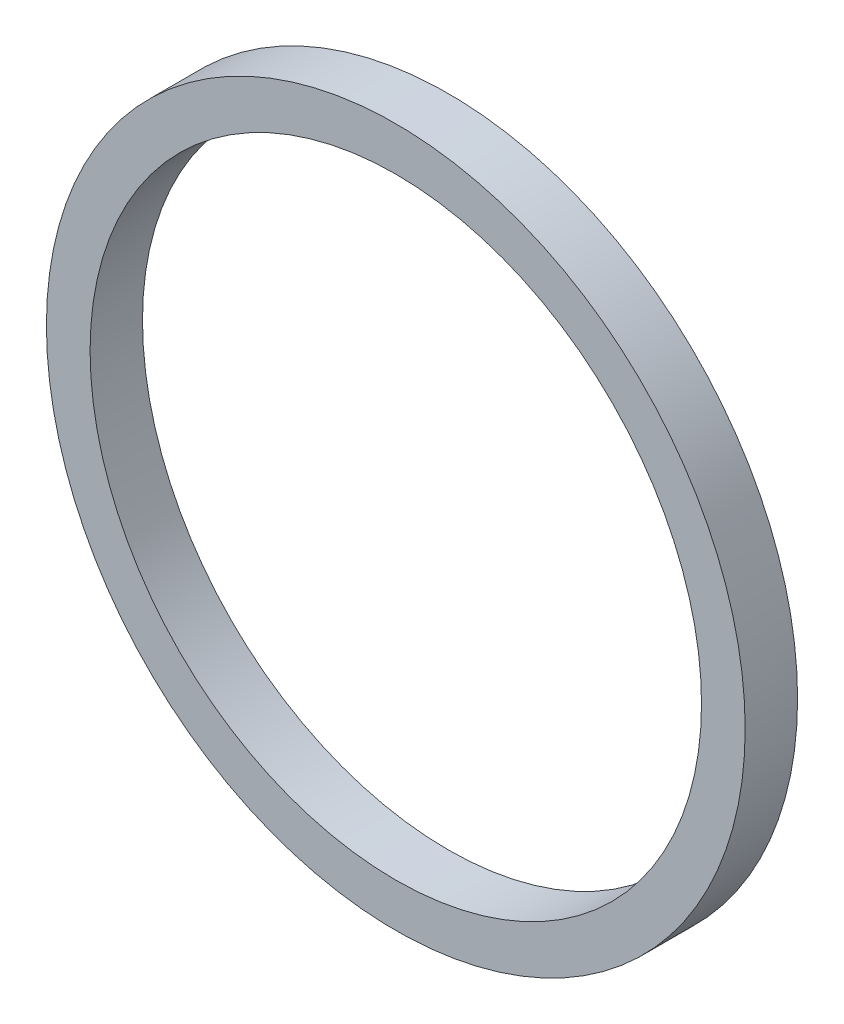
ISO-10303-21;
HEADER;
FILE_DESCRIPTION(('STEP AP214'),'2;1');
FILE_NAME('part.step','',(''),(''),'','','');
FILE_SCHEMA(('AUTOMOTIVE_DESIGN { 1 0 10303 214 1 1 1 1 }'));
ENDSEC;
DATA;
#1=APPLICATION_CONTEXT('core data for automotive mechanical design processes');
#2=APPLICATION_PROTOCOL_DEFINITION('international standard','automotive_design',2000,#1);
#3=PRODUCT_CONTEXT('',#1,'mechanical');
#4=PRODUCT('Part','Part','',(#3));
#5=PRODUCT_RELATED_PRODUCT_CATEGORY('part','',(#4));
#6=PRODUCT_DEFINITION_FORMATION('','',#4);
#7=PRODUCT_DEFINITION_CONTEXT('part definition',#1,'design');
#8=PRODUCT_DEFINITION('design','',#6,#7);
#9=PRODUCT_DEFINITION_SHAPE('','',#8);
#10=(LENGTH_UNIT() NAMED_UNIT(*) SI_UNIT(.MILLI.,.METRE.));
#11=(NAMED_UNIT(*) PLANE_ANGLE_UNIT() SI_UNIT($,.RADIAN.));
#12=(NAMED_UNIT(*) SI_UNIT($,.STERADIAN.) SOLID_ANGLE_UNIT());
#13=UNCERTAINTY_MEASURE_WITH_UNIT(LENGTH_MEASURE(1.E-05),#10,'distance_accuracy_value','');
#14=(GEOMETRIC_REPRESENTATION_CONTEXT(3) GLOBAL_UNCERTAINTY_ASSIGNED_CONTEXT((#13)) GLOBAL_UNIT_ASSIGNED_CONTEXT((#10,
#11,#12)) REPRESENTATION_CONTEXT('',''));
#15=CARTESIAN_POINT('',(0.,0.,0.));
#16=DIRECTION('',(0.,0.,1.));
#17=DIRECTION('',(1.,0.,0.));
#18=AXIS2_PLACEMENT_3D('',#15,#16,#17);
#19=CARTESIAN_POINT('',(0.,0.,6.));
#20=DIRECTION('',(0.,0.,1.));
#21=DIRECTION('',(1.,0.,0.));
#22=AXIS2_PLACEMENT_3D('',#19,#20,#21);
#23=PLANE('',#22);
#24=CARTESIAN_POINT('',(0.,0.,6.));
#25=DIRECTION('',(0.,0.,1.));
#26=DIRECTION('',(1.,0.,0.));
#27=AXIS2_PLACEMENT_3D('',#24,#25,#26);
#28=CIRCLE('',#27,40.);
#29=CARTESIAN_POINT('',(40.,0.,6.));
#30=VERTEX_POINT('',#29);
#31=EDGE_CURVE('E10',#30,#30,#28,.T.);
#32=ORIENTED_EDGE('',*,*,#31,.T.);
#33=EDGE_LOOP('',(#32));
#34=FACE_BOUND('',#33,.T.);
#35=CARTESIAN_POINT('',(0.,0.,6.));
#36=DIRECTION('',(0.,0.,1.));
#37=DIRECTION('',(1.,0.,0.));
#38=AXIS2_PLACEMENT_3D('',#35,#36,#37);
#39=CIRCLE('',#38,35.);
#40=CARTESIAN_POINT('',(35.,0.,6.));
#41=VERTEX_POINT('',#40);
#42=EDGE_CURVE('E45',#41,#41,#39,.T.);
#43=ORIENTED_EDGE('',*,*,#42,.F.);
#44=EDGE_LOOP('',(#43));
#45=FACE_BOUND('',#44,.T.);
#46=ADVANCED_FACE('F34',(#34,#45),#23,.T.);
#47=CARTESIAN_POINT('',(0.,0.,0.));
#48=DIRECTION('',(0.,0.,1.));
#49=DIRECTION('',(1.,0.,0.));
#50=AXIS2_PLACEMENT_3D('',#47,#48,#49);
#51=PLANE('',#50);
#52=CARTESIAN_POINT('',(0.,0.,0.));
#53=DIRECTION('',(0.,0.,1.));
#54=DIRECTION('',(1.,0.,0.));
#55=AXIS2_PLACEMENT_3D('',#52,#53,#54);
#56=CIRCLE('',#55,40.);
#57=CARTESIAN_POINT('',(40.,0.,0.));
#58=VERTEX_POINT('',#57);
#59=EDGE_CURVE('E38',#58,#58,#56,.T.);
#60=ORIENTED_EDGE('',*,*,#59,.F.);
#61=EDGE_LOOP('',(#60));
#62=FACE_BOUND('',#61,.T.);
#63=CARTESIAN_POINT('',(0.,0.,0.));
#64=DIRECTION('',(0.,0.,1.));
#65=DIRECTION('',(1.,0.,0.));
#66=AXIS2_PLACEMENT_3D('',#63,#64,#65);
#67=CIRCLE('',#66,35.);
#68=CARTESIAN_POINT('',(35.,0.,0.));
#69=VERTEX_POINT('',#68);
#70=EDGE_CURVE('E47',#69,#69,#67,.T.);
#71=ORIENTED_EDGE('',*,*,#70,.T.);
#72=EDGE_LOOP('',(#71));
#73=FACE_BOUND('',#72,.T.);
#74=ADVANCED_FACE('F57',(#62,#73),#51,.F.);
#75=CARTESIAN_POINT('',(0.,0.,6.));
#76=DIRECTION('',(0.,0.,-1.));
#77=DIRECTION('',(-1.,0.,0.));
#78=AXIS2_PLACEMENT_3D('',#75,#76,#77);
#79=CYLINDRICAL_SURFACE('',#78,40.);
#80=ORIENTED_EDGE('',*,*,#31,.F.);
#81=EDGE_LOOP('',(#80));
#82=FACE_BOUND('',#81,.T.);
#83=ORIENTED_EDGE('',*,*,#59,.T.);
#84=EDGE_LOOP('',(#83));
#85=FACE_BOUND('',#84,.T.);
#86=ADVANCED_FACE('F36',(#82,#85),#79,.T.);
#87=CARTESIAN_POINT('',(0.,0.,6.));
#88=DIRECTION('',(0.,0.,-1.));
#89=DIRECTION('',(-1.,0.,0.));
#90=AXIS2_PLACEMENT_3D('',#87,#88,#89);
#91=CYLINDRICAL_SURFACE('',#90,35.);
#92=ORIENTED_EDGE('',*,*,#42,.T.);
#93=EDGE_LOOP('',(#92));
#94=FACE_BOUND('',#93,.T.);
#95=ORIENTED_EDGE('',*,*,#70,.F.);
#96=EDGE_LOOP('',(#95));
#97=FACE_BOUND('',#96,.T.);
#98=ADVANCED_FACE('F53',(#94,#97),#91,.F.);
#99=CLOSED_SHELL('',(#46,#74,#86,#98));
#100=MANIFOLD_SOLID_BREP('B2',#99);
#101=ADVANCED_BREP_SHAPE_REPRESENTATION('',(#18,#100),#14);
#102=SHAPE_DEFINITION_REPRESENTATION(#9,#101);
ENDSEC;
END-ISO-10303-21;
